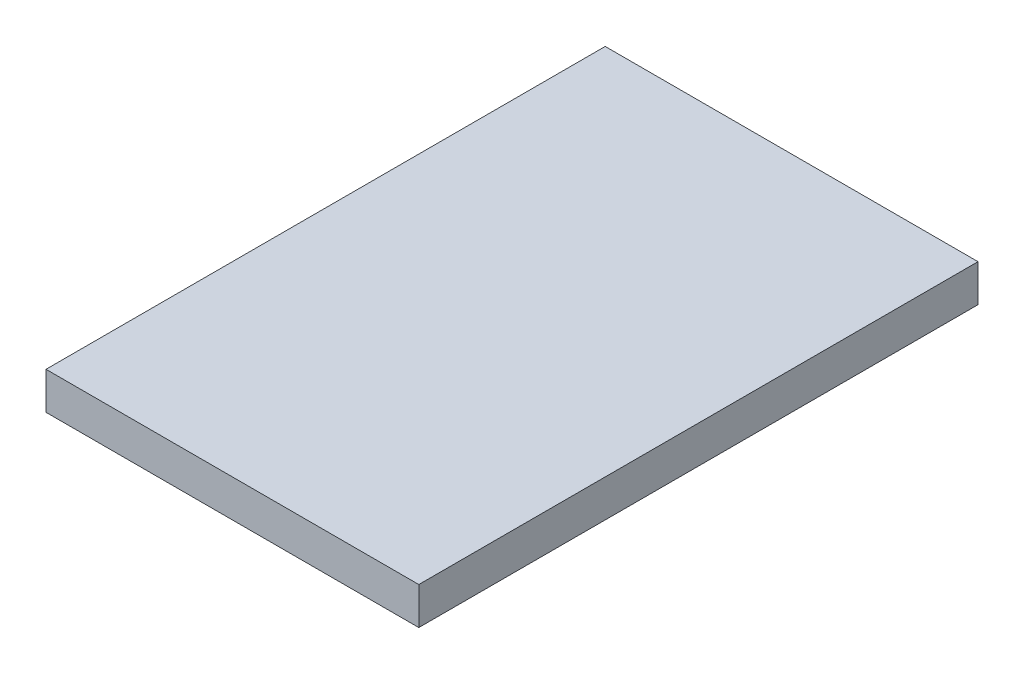
ISO-10303-21;
HEADER;
FILE_DESCRIPTION(('STEP AP214'),'2;1');
FILE_NAME('part.step','',(''),(''),'','','');
FILE_SCHEMA(('AUTOMOTIVE_DESIGN { 1 0 10303 214 1 1 1 1 }'));
ENDSEC;
DATA;
#1=APPLICATION_CONTEXT('core data for automotive mechanical design processes');
#2=APPLICATION_PROTOCOL_DEFINITION('international standard','automotive_design',2000,#1);
#3=PRODUCT_CONTEXT('',#1,'mechanical');
#4=PRODUCT('Part','Part','',(#3));
#5=PRODUCT_RELATED_PRODUCT_CATEGORY('part','',(#4));
#6=PRODUCT_DEFINITION_FORMATION('','',#4);
#7=PRODUCT_DEFINITION_CONTEXT('part definition',#1,'design');
#8=PRODUCT_DEFINITION('design','',#6,#7);
#9=PRODUCT_DEFINITION_SHAPE('','',#8);
#10=(LENGTH_UNIT() NAMED_UNIT(*) SI_UNIT(.MILLI.,.METRE.));
#11=(NAMED_UNIT(*) PLANE_ANGLE_UNIT() SI_UNIT($,.RADIAN.));
#12=(NAMED_UNIT(*) SI_UNIT($,.STERADIAN.) SOLID_ANGLE_UNIT());
#13=UNCERTAINTY_MEASURE_WITH_UNIT(LENGTH_MEASURE(1.E-05),#10,'distance_accuracy_value','');
#14=(GEOMETRIC_REPRESENTATION_CONTEXT(3) GLOBAL_UNCERTAINTY_ASSIGNED_CONTEXT((#13)) GLOBAL_UNIT_ASSIGNED_CONTEXT((#10,
#11,#12)) REPRESENTATION_CONTEXT('',''));
#15=CARTESIAN_POINT('',(0.,0.,0.));
#16=DIRECTION('',(0.,0.,1.));
#17=DIRECTION('',(1.,0.,0.));
#18=AXIS2_PLACEMENT_3D('',#15,#16,#17);
#19=CARTESIAN_POINT('',(-5.,1.,7.5));
#20=DIRECTION('',(1.,0.,0.));
#21=DIRECTION('',(0.,0.,-1.));
#22=AXIS2_PLACEMENT_3D('',#19,#20,#21);
#23=PLANE('',#22);
#24=DIRECTION('',(0.,0.,1.));
#25=VECTOR('',#24,1.);
#26=CARTESIAN_POINT('',(-5.,0.,7.5));
#27=LINE('',#26,#25);
#28=CARTESIAN_POINT('',(-5.,0.,-7.5));
#29=VERTEX_POINT('',#28);
#30=CARTESIAN_POINT('',(-5.,0.,7.5));
#31=VERTEX_POINT('',#30);
#32=EDGE_CURVE('E100',#29,#31,#27,.T.);
#33=ORIENTED_EDGE('',*,*,#32,.T.);
#34=DIRECTION('',(0.,-1.,0.));
#35=VECTOR('',#34,1.);
#36=CARTESIAN_POINT('',(-5.,1.,7.5));
#37=LINE('',#36,#35);
#38=CARTESIAN_POINT('',(-5.,1.,7.5));
#39=VERTEX_POINT('',#38);
#40=EDGE_CURVE('E11',#39,#31,#37,.T.);
#41=ORIENTED_EDGE('',*,*,#40,.F.);
#42=DIRECTION('',(0.,0.,1.));
#43=VECTOR('',#42,1.);
#44=CARTESIAN_POINT('',(-5.,1.,7.5));
#45=LINE('',#44,#43);
#46=CARTESIAN_POINT('',(-5.,1.,-7.5));
#47=VERTEX_POINT('',#46);
#48=EDGE_CURVE('E88',#47,#39,#45,.T.);
#49=ORIENTED_EDGE('',*,*,#48,.F.);
#50=DIRECTION('',(0.,-1.,0.));
#51=VECTOR('',#50,1.);
#52=CARTESIAN_POINT('',(-5.,1.,-7.5));
#53=LINE('',#52,#51);
#54=EDGE_CURVE('E96',#47,#29,#53,.T.);
#55=ORIENTED_EDGE('',*,*,#54,.T.);
#56=EDGE_LOOP('',(#33,#41,#49,#55));
#57=FACE_BOUND('',#56,.T.);
#58=ADVANCED_FACE('F37',(#57),#23,.F.);
#59=CARTESIAN_POINT('',(5.,1.,7.5));
#60=DIRECTION('',(0.,0.,-1.));
#61=DIRECTION('',(-1.,0.,0.));
#62=AXIS2_PLACEMENT_3D('',#59,#60,#61);
#63=PLANE('',#62);
#64=DIRECTION('',(1.,0.,0.));
#65=VECTOR('',#64,1.);
#66=CARTESIAN_POINT('',(5.,0.,7.5));
#67=LINE('',#66,#65);
#68=CARTESIAN_POINT('',(5.,0.,7.5));
#69=VERTEX_POINT('',#68);
#70=EDGE_CURVE('E92',#31,#69,#67,.T.);
#71=ORIENTED_EDGE('',*,*,#70,.T.);
#72=DIRECTION('',(0.,-1.,0.));
#73=VECTOR('',#72,1.);
#74=CARTESIAN_POINT('',(5.,1.,7.5));
#75=LINE('',#74,#73);
#76=CARTESIAN_POINT('',(5.,1.,7.5));
#77=VERTEX_POINT('',#76);
#78=EDGE_CURVE('E45',#77,#69,#75,.T.);
#79=ORIENTED_EDGE('',*,*,#78,.F.);
#80=DIRECTION('',(1.,0.,0.));
#81=VECTOR('',#80,1.);
#82=CARTESIAN_POINT('',(5.,1.,7.5));
#83=LINE('',#82,#81);
#84=EDGE_CURVE('E83',#39,#77,#83,.T.);
#85=ORIENTED_EDGE('',*,*,#84,.F.);
#86=ORIENTED_EDGE('',*,*,#40,.T.);
#87=EDGE_LOOP('',(#71,#79,#85,#86));
#88=FACE_BOUND('',#87,.T.);
#89=ADVANCED_FACE('F91',(#88),#63,.F.);
#90=CARTESIAN_POINT('',(5.,1.,7.5));
#91=DIRECTION('',(-1.,0.,0.));
#92=DIRECTION('',(0.,0.,1.));
#93=AXIS2_PLACEMENT_3D('',#90,#91,#92);
#94=PLANE('',#93);
#95=DIRECTION('',(0.,0.,-1.));
#96=VECTOR('',#95,1.);
#97=CARTESIAN_POINT('',(5.,0.,7.5));
#98=LINE('',#97,#96);
#99=CARTESIAN_POINT('',(5.,0.,-7.5));
#100=VERTEX_POINT('',#99);
#101=EDGE_CURVE('E70',#69,#100,#98,.T.);
#102=ORIENTED_EDGE('',*,*,#101,.T.);
#103=DIRECTION('',(0.,-1.,0.));
#104=VECTOR('',#103,1.);
#105=CARTESIAN_POINT('',(5.,1.,-7.5));
#106=LINE('',#105,#104);
#107=CARTESIAN_POINT('',(5.,1.,-7.5));
#108=VERTEX_POINT('',#107);
#109=EDGE_CURVE('E93',#108,#100,#106,.T.);
#110=ORIENTED_EDGE('',*,*,#109,.F.);
#111=DIRECTION('',(0.,0.,-1.));
#112=VECTOR('',#111,1.);
#113=CARTESIAN_POINT('',(5.,1.,7.5));
#114=LINE('',#113,#112);
#115=EDGE_CURVE('E86',#77,#108,#114,.T.);
#116=ORIENTED_EDGE('',*,*,#115,.F.);
#117=ORIENTED_EDGE('',*,*,#78,.T.);
#118=EDGE_LOOP('',(#102,#110,#116,#117));
#119=FACE_BOUND('',#118,.T.);
#120=ADVANCED_FACE('F94',(#119),#94,.F.);
#121=CARTESIAN_POINT('',(5.,1.,-7.5));
#122=DIRECTION('',(0.,0.,1.));
#123=DIRECTION('',(1.,0.,0.));
#124=AXIS2_PLACEMENT_3D('',#121,#122,#123);
#125=PLANE('',#124);
#126=DIRECTION('',(-1.,0.,0.));
#127=VECTOR('',#126,1.);
#128=CARTESIAN_POINT('',(5.,0.,-7.5));
#129=LINE('',#128,#127);
#130=EDGE_CURVE('E76',#100,#29,#129,.T.);
#131=ORIENTED_EDGE('',*,*,#130,.T.);
#132=ORIENTED_EDGE('',*,*,#54,.F.);
#133=DIRECTION('',(-1.,0.,0.));
#134=VECTOR('',#133,1.);
#135=CARTESIAN_POINT('',(5.,1.,-7.5));
#136=LINE('',#135,#134);
#137=EDGE_CURVE('E53',#108,#47,#136,.T.);
#138=ORIENTED_EDGE('',*,*,#137,.F.);
#139=ORIENTED_EDGE('',*,*,#109,.T.);
#140=EDGE_LOOP('',(#131,#132,#138,#139));
#141=FACE_BOUND('',#140,.T.);
#142=ADVANCED_FACE('F107',(#141),#125,.F.);
#143=CARTESIAN_POINT('',(0.,1.,0.));
#144=DIRECTION('',(0.,1.,0.));
#145=DIRECTION('',(0.,0.,1.));
#146=AXIS2_PLACEMENT_3D('',#143,#144,#145);
#147=PLANE('',#146);
#148=ORIENTED_EDGE('',*,*,#48,.T.);
#149=ORIENTED_EDGE('',*,*,#84,.T.);
#150=ORIENTED_EDGE('',*,*,#115,.T.);
#151=ORIENTED_EDGE('',*,*,#137,.T.);
#152=EDGE_LOOP('',(#148,#149,#150,#151));
#153=FACE_BOUND('',#152,.T.);
#154=ADVANCED_FACE('F84',(#153),#147,.T.);
#155=CARTESIAN_POINT('',(0.,0.,0.));
#156=DIRECTION('',(0.,1.,0.));
#157=DIRECTION('',(0.,0.,1.));
#158=AXIS2_PLACEMENT_3D('',#155,#156,#157);
#159=PLANE('',#158);
#160=ORIENTED_EDGE('',*,*,#32,.F.);
#161=ORIENTED_EDGE('',*,*,#130,.F.);
#162=ORIENTED_EDGE('',*,*,#101,.F.);
#163=ORIENTED_EDGE('',*,*,#70,.F.);
#164=EDGE_LOOP('',(#160,#161,#162,#163));
#165=FACE_BOUND('',#164,.T.);
#166=ADVANCED_FACE('F110',(#165),#159,.F.);
#167=CLOSED_SHELL('',(#58,#89,#120,#142,#154,#166));
#168=MANIFOLD_SOLID_BREP('B2',#167);
#169=ADVANCED_BREP_SHAPE_REPRESENTATION('',(#18,#168),#14);
#170=SHAPE_DEFINITION_REPRESENTATION(#9,#169);
ENDSEC;
END-ISO-10303-21;
